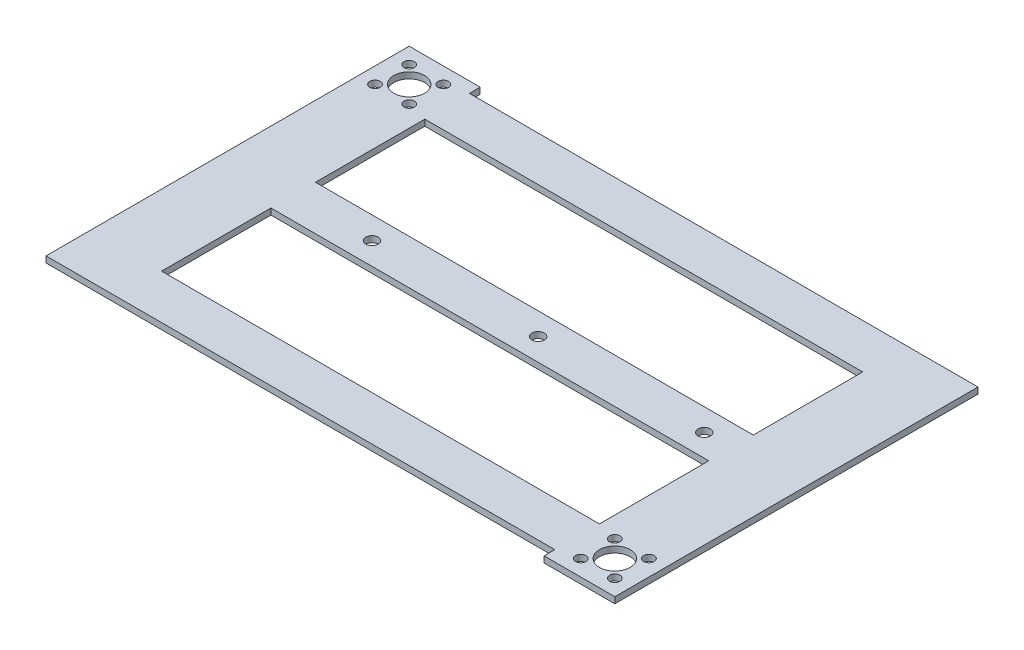
ISO-10303-21;
HEADER;
FILE_DESCRIPTION(('STEP AP214'),'2;1');
FILE_NAME('part.step','',(''),(''),'','','');
FILE_SCHEMA(('AUTOMOTIVE_DESIGN { 1 0 10303 214 1 1 1 1 }'));
ENDSEC;
DATA;
#1=APPLICATION_CONTEXT('core data for automotive mechanical design processes');
#2=APPLICATION_PROTOCOL_DEFINITION('international standard','automotive_design',2000,#1);
#3=PRODUCT_CONTEXT('',#1,'mechanical');
#4=PRODUCT('Part','Part','',(#3));
#5=PRODUCT_RELATED_PRODUCT_CATEGORY('part','',(#4));
#6=PRODUCT_DEFINITION_FORMATION('','',#4);
#7=PRODUCT_DEFINITION_CONTEXT('part definition',#1,'design');
#8=PRODUCT_DEFINITION('design','',#6,#7);
#9=PRODUCT_DEFINITION_SHAPE('','',#8);
#10=(LENGTH_UNIT() NAMED_UNIT(*) SI_UNIT(.MILLI.,.METRE.));
#11=(NAMED_UNIT(*) PLANE_ANGLE_UNIT() SI_UNIT($,.RADIAN.));
#12=(NAMED_UNIT(*) SI_UNIT($,.STERADIAN.) SOLID_ANGLE_UNIT());
#13=UNCERTAINTY_MEASURE_WITH_UNIT(LENGTH_MEASURE(1.E-05),#10,'distance_accuracy_value','');
#14=(GEOMETRIC_REPRESENTATION_CONTEXT(3) GLOBAL_UNCERTAINTY_ASSIGNED_CONTEXT((#13)) GLOBAL_UNIT_ASSIGNED_CONTEXT((#10,
#11,#12)) REPRESENTATION_CONTEXT('',''));
#15=CARTESIAN_POINT('',(0.,0.,0.));
#16=DIRECTION('',(0.,0.,1.));
#17=DIRECTION('',(1.,0.,0.));
#18=AXIS2_PLACEMENT_3D('',#15,#16,#17);
#19=CARTESIAN_POINT('',(0.,2.,0.));
#20=DIRECTION('',(0.,1.,0.));
#21=DIRECTION('',(0.,0.,1.));
#22=AXIS2_PLACEMENT_3D('',#19,#20,#21);
#23=PLANE('',#22);
#24=CARTESIAN_POINT('',(0.,2.,-92.8338294378388));
#25=DIRECTION('',(0.,1.,0.));
#26=DIRECTION('',(0.,0.,1.));
#27=AXIS2_PLACEMENT_3D('',#24,#25,#26);
#28=CIRCLE('',#27,2.);
#29=CARTESIAN_POINT('',(0.,2.,-90.8338294378388));
#30=VERTEX_POINT('',#29);
#31=EDGE_CURVE('E851',#30,#30,#28,.T.);
#32=ORIENTED_EDGE('',*,*,#31,.F.);
#33=EDGE_LOOP('',(#32));
#34=FACE_BOUND('',#33,.T.);
#35=DIRECTION('',(1.,0.,0.));
#36=VECTOR('',#35,1.);
#37=CARTESIAN_POINT('',(-79.6431533882812,2.,-100.08270003643));
#38=LINE('',#37,#36);
#39=CARTESIAN_POINT('',(-79.6431533882812,2.,-100.08270003643));
#40=VERTEX_POINT('',#39);
#41=CARTESIAN_POINT('',(62.7304912118065,2.,-100.08270003643));
#42=VERTEX_POINT('',#41);
#43=EDGE_CURVE('E166',#40,#42,#38,.T.);
#44=ORIENTED_EDGE('',*,*,#43,.F.);
#45=DIRECTION('',(0.,0.,1.));
#46=VECTOR('',#45,1.);
#47=CARTESIAN_POINT('',(-79.6431533882812,2.,-135.633829437839));
#48=LINE('',#47,#46);
#49=CARTESIAN_POINT('',(-79.6431533882812,2.,-135.633829437839));
#50=VERTEX_POINT('',#49);
#51=EDGE_CURVE('E157',#50,#40,#48,.T.);
#52=ORIENTED_EDGE('',*,*,#51,.F.);
#53=DIRECTION('',(-1.,0.,0.));
#54=VECTOR('',#53,1.);
#55=CARTESIAN_POINT('',(-79.6431533882812,2.,-135.633829437839));
#56=LINE('',#55,#54);
#57=CARTESIAN_POINT('',(62.7304912118065,2.,-135.633829437839));
#58=VERTEX_POINT('',#57);
#59=EDGE_CURVE('E184',#58,#50,#56,.T.);
#60=ORIENTED_EDGE('',*,*,#59,.F.);
#61=DIRECTION('',(0.,0.,-1.));
#62=VECTOR('',#61,1.);
#63=CARTESIAN_POINT('',(62.7304912118065,2.,-100.08270003643));
#64=LINE('',#63,#62);
#65=EDGE_CURVE('E180',#42,#58,#64,.T.);
#66=ORIENTED_EDGE('',*,*,#65,.F.);
#67=EDGE_LOOP('',(#44,#52,#60,#66));
#68=FACE_BOUND('',#67,.T.);
#69=CARTESIAN_POINT('',(74.9804912118065,2.,-42.781570635021));
#70=DIRECTION('',(0.,1.,0.));
#71=DIRECTION('',(0.,0.,1.));
#72=AXIS2_PLACEMENT_3D('',#69,#70,#71);
#73=CIRCLE('',#72,4.99999999999999);
#74=CARTESIAN_POINT('',(74.9804912118065,2.,-37.781570635021));
#75=VERTEX_POINT('',#74);
#76=EDGE_CURVE('E208',#75,#75,#73,.T.);
#77=ORIENTED_EDGE('',*,*,#76,.F.);
#78=EDGE_LOOP('',(#77));
#79=FACE_BOUND('',#78,.T.);
#80=CARTESIAN_POINT('',(80.5304912118065,2.,-37.231570635021));
#81=DIRECTION('',(0.,1.,0.));
#82=DIRECTION('',(0.,0.,1.));
#83=AXIS2_PLACEMENT_3D('',#80,#81,#82);
#84=CIRCLE('',#83,1.70000000000001);
#85=CARTESIAN_POINT('',(80.5304912118065,2.,-35.531570635021));
#86=VERTEX_POINT('',#85);
#87=EDGE_CURVE('E267',#86,#86,#84,.T.);
#88=ORIENTED_EDGE('',*,*,#87,.F.);
#89=EDGE_LOOP('',(#88));
#90=FACE_BOUND('',#89,.T.);
#91=CARTESIAN_POINT('',(69.4304912118065,2.,-48.331570635021));
#92=DIRECTION('',(0.,1.,0.));
#93=DIRECTION('',(0.,0.,1.));
#94=AXIS2_PLACEMENT_3D('',#91,#92,#93);
#95=CIRCLE('',#94,1.70000000000001);
#96=CARTESIAN_POINT('',(69.4304912118065,2.,-46.631570635021));
#97=VERTEX_POINT('',#96);
#98=EDGE_CURVE('E283',#97,#97,#95,.T.);
#99=ORIENTED_EDGE('',*,*,#98,.F.);
#100=EDGE_LOOP('',(#99));
#101=FACE_BOUND('',#100,.T.);
#102=CARTESIAN_POINT('',(-91.9770260023349,2.,-142.883829437839));
#103=DIRECTION('',(0.,1.,0.));
#104=DIRECTION('',(0.,0.,1.));
#105=AXIS2_PLACEMENT_3D('',#102,#103,#104);
#106=CIRCLE('',#105,5.00000000000001);
#107=CARTESIAN_POINT('',(-91.9770260023349,2.,-137.883829437839));
#108=VERTEX_POINT('',#107);
#109=EDGE_CURVE('E299',#108,#108,#106,.T.);
#110=ORIENTED_EDGE('',*,*,#109,.F.);
#111=EDGE_LOOP('',(#110));
#112=FACE_BOUND('',#111,.T.);
#113=CARTESIAN_POINT('',(-97.5270260023347,2.,-148.43382943784));
#114=DIRECTION('',(0.,1.,0.));
#115=DIRECTION('',(0.,0.,-1.));
#116=AXIS2_PLACEMENT_3D('',#113,#114,#115);
#117=CIRCLE('',#116,1.70000000000002);
#118=CARTESIAN_POINT('',(-97.5270260023347,2.,-150.13382943784));
#119=VERTEX_POINT('',#118);
#120=EDGE_CURVE('E315',#119,#119,#117,.T.);
#121=ORIENTED_EDGE('',*,*,#120,.F.);
#122=EDGE_LOOP('',(#121));
#123=FACE_BOUND('',#122,.T.);
#124=DIRECTION('',(0.,0.,-1.));
#125=VECTOR('',#124,1.);
#126=CARTESIAN_POINT('',(85.7304912118065,2.,-100.08270003643));
#127=LINE('',#126,#125);
#128=CARTESIAN_POINT('',(85.7304912118065,2.,-32.031570635021));
#129=VERTEX_POINT('',#128);
#130=CARTESIAN_POINT('',(85.7304912118065,2.,-150.13382943784));
#131=VERTEX_POINT('',#130);
#132=EDGE_CURVE('E331',#129,#131,#127,.T.);
#133=ORIENTED_EDGE('',*,*,#132,.T.);
#134=DIRECTION('',(-1.,0.,0.));
#135=VECTOR('',#134,1.);
#136=CARTESIAN_POINT('',(85.7304912118065,2.,-150.13382943784));
#137=LINE('',#136,#135);
#138=CARTESIAN_POINT('',(-79.6431533882812,2.,-150.13382943784));
#139=VERTEX_POINT('',#138);
#140=EDGE_CURVE('E334',#131,#139,#137,.T.);
#141=ORIENTED_EDGE('',*,*,#140,.T.);
#142=DIRECTION('',(0.,0.,-1.));
#143=VECTOR('',#142,1.);
#144=CARTESIAN_POINT('',(-79.6431533882812,2.,-153.432122466439));
#145=LINE('',#144,#143);
#146=CARTESIAN_POINT('',(-79.6431533882812,2.,-153.633829437839));
#147=VERTEX_POINT('',#146);
#148=EDGE_CURVE('E338',#139,#147,#145,.T.);
#149=ORIENTED_EDGE('',*,*,#148,.T.);
#150=DIRECTION('',(-1.,0.,0.));
#151=VECTOR('',#150,1.);
#152=CARTESIAN_POINT('',(-84.6431533882812,2.,-153.633829437839));
#153=LINE('',#152,#151);
#154=CARTESIAN_POINT('',(-102.727026002335,2.,-153.633829437839));
#155=VERTEX_POINT('',#154);
#156=EDGE_CURVE('E341',#147,#155,#153,.T.);
#157=ORIENTED_EDGE('',*,*,#156,.T.);
#158=DIRECTION('',(0.,0.,1.));
#159=VECTOR('',#158,1.);
#160=CARTESIAN_POINT('',(-102.727026002335,2.,-100.08270003643));
#161=LINE('',#160,#159);
#162=CARTESIAN_POINT('',(-102.727026002335,2.,-35.531570635021));
#163=VERTEX_POINT('',#162);
#164=EDGE_CURVE('E344',#155,#163,#161,.T.);
#165=ORIENTED_EDGE('',*,*,#164,.T.);
#166=DIRECTION('',(1.,0.,0.));
#167=VECTOR('',#166,1.);
#168=CARTESIAN_POINT('',(-102.727026002335,2.,-35.531570635021));
#169=LINE('',#168,#167);
#170=CARTESIAN_POINT('',(62.7304912118065,2.,-35.531570635021));
#171=VERTEX_POINT('',#170);
#172=EDGE_CURVE('E347',#163,#171,#169,.T.);
#173=ORIENTED_EDGE('',*,*,#172,.T.);
#174=DIRECTION('',(0.,0.,1.));
#175=VECTOR('',#174,1.);
#176=CARTESIAN_POINT('',(62.7304912118065,2.,-32.031570635021));
#177=LINE('',#176,#175);
#178=CARTESIAN_POINT('',(62.7304912118065,2.,-32.031570635021));
#179=VERTEX_POINT('',#178);
#180=EDGE_CURVE('E350',#171,#179,#177,.T.);
#181=ORIENTED_EDGE('',*,*,#180,.T.);
#182=DIRECTION('',(1.,0.,0.));
#183=VECTOR('',#182,1.);
#184=CARTESIAN_POINT('',(67.7304912118065,2.,-32.031570635021));
#185=LINE('',#184,#183);
#186=EDGE_CURVE('E353',#179,#129,#185,.T.);
#187=ORIENTED_EDGE('',*,*,#186,.T.);
#188=EDGE_LOOP('',(#133,#141,#149,#157,#165,#173,#181,#187));
#189=FACE_BOUND('',#188,.T.);
#190=CARTESIAN_POINT('',(-86.4270260023345,2.,-148.433829437839));
#191=DIRECTION('',(0.,1.,0.));
#192=DIRECTION('',(0.,0.,1.));
#193=AXIS2_PLACEMENT_3D('',#190,#191,#192);
#194=CIRCLE('',#193,1.70000000000001);
#195=CARTESIAN_POINT('',(-86.4270260023345,2.,-146.733829437839));
#196=VERTEX_POINT('',#195);
#197=EDGE_CURVE('E323',#196,#196,#194,.T.);
#198=ORIENTED_EDGE('',*,*,#197,.F.);
#199=EDGE_LOOP('',(#198));
#200=FACE_BOUND('',#199,.T.);
#201=CARTESIAN_POINT('',(-86.4270260023344,2.,-137.333829437839));
#202=DIRECTION('',(0.,1.,0.));
#203=DIRECTION('',(0.,0.,-1.));
#204=AXIS2_PLACEMENT_3D('',#201,#202,#203);
#205=CIRCLE('',#204,1.70000000000001);
#206=CARTESIAN_POINT('',(-86.4270260023344,2.,-139.033829437839));
#207=VERTEX_POINT('',#206);
#208=EDGE_CURVE('E307',#207,#207,#205,.T.);
#209=ORIENTED_EDGE('',*,*,#208,.F.);
#210=EDGE_LOOP('',(#209));
#211=FACE_BOUND('',#210,.T.);
#212=CARTESIAN_POINT('',(-97.5270260023347,2.,-137.333829437839));
#213=DIRECTION('',(0.,1.,0.));
#214=DIRECTION('',(0.,0.,1.));
#215=AXIS2_PLACEMENT_3D('',#212,#213,#214);
#216=CIRCLE('',#215,1.70000000000001);
#217=CARTESIAN_POINT('',(-97.5270260023347,2.,-135.633829437839));
#218=VERTEX_POINT('',#217);
#219=EDGE_CURVE('E291',#218,#218,#216,.T.);
#220=ORIENTED_EDGE('',*,*,#219,.F.);
#221=EDGE_LOOP('',(#220));
#222=FACE_BOUND('',#221,.T.);
#223=CARTESIAN_POINT('',(80.5304912118065,2.,-48.331570635021));
#224=DIRECTION('',(0.,1.,0.));
#225=DIRECTION('',(0.,0.,-1.));
#226=AXIS2_PLACEMENT_3D('',#223,#224,#225);
#227=CIRCLE('',#226,1.70000000000001);
#228=CARTESIAN_POINT('',(80.5304912118065,2.,-50.031570635021));
#229=VERTEX_POINT('',#228);
#230=EDGE_CURVE('E275',#229,#229,#227,.T.);
#231=ORIENTED_EDGE('',*,*,#230,.F.);
#232=EDGE_LOOP('',(#231));
#233=FACE_BOUND('',#232,.T.);
#234=CARTESIAN_POINT('',(69.4304912118065,2.,-37.231570635021));
#235=DIRECTION('',(0.,1.,0.));
#236=DIRECTION('',(0.,0.,-1.));
#237=AXIS2_PLACEMENT_3D('',#234,#235,#236);
#238=CIRCLE('',#237,1.70000000000001);
#239=CARTESIAN_POINT('',(69.4304912118065,2.,-38.931570635021));
#240=VERTEX_POINT('',#239);
#241=EDGE_CURVE('E259',#240,#240,#238,.T.);
#242=ORIENTED_EDGE('',*,*,#241,.F.);
#243=EDGE_LOOP('',(#242));
#244=FACE_BOUND('',#243,.T.);
#245=DIRECTION('',(1.,0.,0.));
#246=VECTOR('',#245,1.);
#247=CARTESIAN_POINT('',(-79.6431533882812,2.,-50.031570635021));
#248=LINE('',#247,#246);
#249=CARTESIAN_POINT('',(-79.6431533882812,2.,-50.031570635021));
#250=VERTEX_POINT('',#249);
#251=CARTESIAN_POINT('',(62.7304912118065,2.,-50.031570635021));
#252=VERTEX_POINT('',#251);
#253=EDGE_CURVE('E219',#250,#252,#248,.T.);
#254=ORIENTED_EDGE('',*,*,#253,.F.);
#255=DIRECTION('',(0.,0.,1.));
#256=VECTOR('',#255,1.);
#257=CARTESIAN_POINT('',(-79.6431533882812,2.,-85.5827000364299));
#258=LINE('',#257,#256);
#259=CARTESIAN_POINT('',(-79.6431533882812,2.,-85.5827000364299));
#260=VERTEX_POINT('',#259);
#261=EDGE_CURVE('E216',#260,#250,#258,.T.);
#262=ORIENTED_EDGE('',*,*,#261,.F.);
#263=DIRECTION('',(-1.,0.,0.));
#264=VECTOR('',#263,1.);
#265=CARTESIAN_POINT('',(-79.6431533882812,2.,-85.5827000364299));
#266=LINE('',#265,#264);
#267=CARTESIAN_POINT('',(62.7304912118065,2.,-85.5827000364299));
#268=VERTEX_POINT('',#267);
#269=EDGE_CURVE('E227',#268,#260,#266,.T.);
#270=ORIENTED_EDGE('',*,*,#269,.F.);
#271=DIRECTION('',(0.,0.,-1.));
#272=VECTOR('',#271,1.);
#273=CARTESIAN_POINT('',(62.7304912118065,2.,-50.031570635021));
#274=LINE('',#273,#272);
#275=EDGE_CURVE('E223',#252,#268,#274,.T.);
#276=ORIENTED_EDGE('',*,*,#275,.F.);
#277=EDGE_LOOP('',(#254,#262,#270,#276));
#278=FACE_BOUND('',#277,.T.);
#279=CARTESIAN_POINT('',(-54.,2.,-92.8338294378388));
#280=DIRECTION('',(0.,1.,0.));
#281=DIRECTION('',(0.,0.,1.));
#282=AXIS2_PLACEMENT_3D('',#279,#280,#281);
#283=CIRCLE('',#282,2.);
#284=CARTESIAN_POINT('',(-54.,2.,-90.8338294378388));
#285=VERTEX_POINT('',#284);
#286=EDGE_CURVE('E192',#285,#285,#283,.T.);
#287=ORIENTED_EDGE('',*,*,#286,.F.);
#288=EDGE_LOOP('',(#287));
#289=FACE_BOUND('',#288,.T.);
#290=CARTESIAN_POINT('',(54.,2.,-92.8338294378388));
#291=DIRECTION('',(0.,1.,0.));
#292=DIRECTION('',(0.,0.,1.));
#293=AXIS2_PLACEMENT_3D('',#290,#291,#292);
#294=CIRCLE('',#293,2.);
#295=CARTESIAN_POINT('',(54.,2.,-90.8338294378388));
#296=VERTEX_POINT('',#295);
#297=EDGE_CURVE('E840',#296,#296,#294,.T.);
#298=ORIENTED_EDGE('',*,*,#297,.F.);
#299=EDGE_LOOP('',(#298));
#300=FACE_BOUND('',#299,.T.);
#301=ADVANCED_FACE('F43',(#34,#68,#79,#90,#101,#112,#123,#189,#200,#211,#222,#233,#244,#278,
#289,#300),#23,.T.);
#302=CARTESIAN_POINT('',(0.,0.,0.));
#303=DIRECTION('',(0.,1.,0.));
#304=DIRECTION('',(0.,0.,1.));
#305=AXIS2_PLACEMENT_3D('',#302,#303,#304);
#306=PLANE('',#305);
#307=CARTESIAN_POINT('',(74.9804912118065,0.,-42.781570635021));
#308=DIRECTION('',(0.,1.,0.));
#309=DIRECTION('',(0.,0.,1.));
#310=AXIS2_PLACEMENT_3D('',#307,#308,#309);
#311=CIRCLE('',#310,4.99999999999999);
#312=CARTESIAN_POINT('',(74.9804912118065,0.,-37.781570635021));
#313=VERTEX_POINT('',#312);
#314=EDGE_CURVE('E175',#313,#313,#311,.T.);
#315=ORIENTED_EDGE('',*,*,#314,.T.);
#316=EDGE_LOOP('',(#315));
#317=FACE_BOUND('',#316,.T.);
#318=DIRECTION('',(0.,0.,1.));
#319=VECTOR('',#318,1.);
#320=CARTESIAN_POINT('',(-79.6431533882812,0.,-85.5827000364299));
#321=LINE('',#320,#319);
#322=CARTESIAN_POINT('',(-79.6431533882812,0.,-85.5827000364299));
#323=VERTEX_POINT('',#322);
#324=CARTESIAN_POINT('',(-79.6431533882812,0.,-50.031570635021));
#325=VERTEX_POINT('',#324);
#326=EDGE_CURVE('E212',#323,#325,#321,.T.);
#327=ORIENTED_EDGE('',*,*,#326,.T.);
#328=DIRECTION('',(1.,0.,0.));
#329=VECTOR('',#328,1.);
#330=CARTESIAN_POINT('',(-79.6431533882812,0.,-50.031570635021));
#331=LINE('',#330,#329);
#332=CARTESIAN_POINT('',(62.7304912118065,0.,-50.031570635021));
#333=VERTEX_POINT('',#332);
#334=EDGE_CURVE('E234',#325,#333,#331,.T.);
#335=ORIENTED_EDGE('',*,*,#334,.T.);
#336=DIRECTION('',(0.,0.,-1.));
#337=VECTOR('',#336,1.);
#338=CARTESIAN_POINT('',(62.7304912118065,0.,-50.031570635021));
#339=LINE('',#338,#337);
#340=CARTESIAN_POINT('',(62.7304912118065,0.,-85.5827000364299));
#341=VERTEX_POINT('',#340);
#342=EDGE_CURVE('E238',#333,#341,#339,.T.);
#343=ORIENTED_EDGE('',*,*,#342,.T.);
#344=DIRECTION('',(-1.,0.,0.));
#345=VECTOR('',#344,1.);
#346=CARTESIAN_POINT('',(-79.6431533882812,0.,-85.5827000364299));
#347=LINE('',#346,#345);
#348=EDGE_CURVE('E220',#341,#323,#347,.T.);
#349=ORIENTED_EDGE('',*,*,#348,.T.);
#350=EDGE_LOOP('',(#327,#335,#343,#349));
#351=FACE_BOUND('',#350,.T.);
#352=DIRECTION('',(-1.,0.,0.));
#353=VECTOR('',#352,1.);
#354=CARTESIAN_POINT('',(-79.6431533882812,0.,-150.13382943784));
#355=LINE('',#354,#353);
#356=CARTESIAN_POINT('',(85.7304912118065,0.,-150.13382943784));
#357=VERTEX_POINT('',#356);
#358=CARTESIAN_POINT('',(-79.6431533882812,0.,-150.13382943784));
#359=VERTEX_POINT('',#358);
#360=EDGE_CURVE('E327',#357,#359,#355,.T.);
#361=ORIENTED_EDGE('',*,*,#360,.F.);
#362=DIRECTION('',(0.,0.,-1.));
#363=VECTOR('',#362,1.);
#364=CARTESIAN_POINT('',(85.7304912118065,0.,-50.031570635021));
#365=LINE('',#364,#363);
#366=CARTESIAN_POINT('',(85.7304912118065,0.,-32.031570635021));
#367=VERTEX_POINT('',#366);
#368=EDGE_CURVE('E335',#367,#357,#365,.T.);
#369=ORIENTED_EDGE('',*,*,#368,.F.);
#370=DIRECTION('',(1.,0.,0.));
#371=VECTOR('',#370,1.);
#372=CARTESIAN_POINT('',(67.7304912118065,0.,-32.031570635021));
#373=LINE('',#372,#371);
#374=CARTESIAN_POINT('',(62.7304912118065,0.,-32.031570635021));
#375=VERTEX_POINT('',#374);
#376=EDGE_CURVE('E379',#375,#367,#373,.T.);
#377=ORIENTED_EDGE('',*,*,#376,.F.);
#378=DIRECTION('',(0.,0.,1.));
#379=VECTOR('',#378,1.);
#380=CARTESIAN_POINT('',(62.7304912118065,0.,-32.031570635021));
#381=LINE('',#380,#379);
#382=CARTESIAN_POINT('',(62.7304912118065,0.,-35.531570635021));
#383=VERTEX_POINT('',#382);
#384=EDGE_CURVE('E375',#383,#375,#381,.T.);
#385=ORIENTED_EDGE('',*,*,#384,.F.);
#386=DIRECTION('',(1.,0.,0.));
#387=VECTOR('',#386,1.);
#388=CARTESIAN_POINT('',(-84.7270260023345,0.,-35.531570635021));
#389=LINE('',#388,#387);
#390=CARTESIAN_POINT('',(-102.727026002335,0.,-35.531570635021));
#391=VERTEX_POINT('',#390);
#392=EDGE_CURVE('E372',#391,#383,#389,.T.);
#393=ORIENTED_EDGE('',*,*,#392,.F.);
#394=DIRECTION('',(0.,0.,1.));
#395=VECTOR('',#394,1.);
#396=CARTESIAN_POINT('',(-102.727026002335,0.,-85.5827000364299));
#397=LINE('',#396,#395);
#398=CARTESIAN_POINT('',(-102.727026002335,0.,-153.633829437839));
#399=VERTEX_POINT('',#398);
#400=EDGE_CURVE('E368',#399,#391,#397,.T.);
#401=ORIENTED_EDGE('',*,*,#400,.F.);
#402=DIRECTION('',(-1.,0.,0.));
#403=VECTOR('',#402,1.);
#404=CARTESIAN_POINT('',(-84.6431533882812,0.,-153.633829437839));
#405=LINE('',#404,#403);
#406=CARTESIAN_POINT('',(-79.6431533882812,0.,-153.633829437839));
#407=VERTEX_POINT('',#406);
#408=EDGE_CURVE('E364',#407,#399,#405,.T.);
#409=ORIENTED_EDGE('',*,*,#408,.F.);
#410=DIRECTION('',(0.,0.,-1.));
#411=VECTOR('',#410,1.);
#412=CARTESIAN_POINT('',(-79.6431533882812,0.,-153.432122466439));
#413=LINE('',#412,#411);
#414=EDGE_CURVE('E360',#359,#407,#413,.T.);
#415=ORIENTED_EDGE('',*,*,#414,.F.);
#416=EDGE_LOOP('',(#361,#369,#377,#385,#393,#401,#409,#415));
#417=FACE_BOUND('',#416,.T.);
#418=CARTESIAN_POINT('',(-86.4270260023345,0.,-148.433829437839));
#419=DIRECTION('',(0.,1.,0.));
#420=DIRECTION('',(0.,0.,1.));
#421=AXIS2_PLACEMENT_3D('',#418,#419,#420);
#422=CIRCLE('',#421,1.70000000000001);
#423=CARTESIAN_POINT('',(-86.4270260023345,0.,-146.733829437839));
#424=VERTEX_POINT('',#423);
#425=EDGE_CURVE('E319',#424,#424,#422,.T.);
#426=ORIENTED_EDGE('',*,*,#425,.T.);
#427=EDGE_LOOP('',(#426));
#428=FACE_BOUND('',#427,.T.);
#429=CARTESIAN_POINT('',(-97.5270260023347,0.,-148.43382943784));
#430=DIRECTION('',(0.,1.,0.));
#431=DIRECTION('',(0.,0.,-1.));
#432=AXIS2_PLACEMENT_3D('',#429,#430,#431);
#433=CIRCLE('',#432,1.70000000000002);
#434=CARTESIAN_POINT('',(-97.5270260023347,0.,-150.13382943784));
#435=VERTEX_POINT('',#434);
#436=EDGE_CURVE('E311',#435,#435,#433,.T.);
#437=ORIENTED_EDGE('',*,*,#436,.T.);
#438=EDGE_LOOP('',(#437));
#439=FACE_BOUND('',#438,.T.);
#440=CARTESIAN_POINT('',(-86.4270260023344,0.,-137.333829437839));
#441=DIRECTION('',(0.,1.,0.));
#442=DIRECTION('',(0.,0.,-1.));
#443=AXIS2_PLACEMENT_3D('',#440,#441,#442);
#444=CIRCLE('',#443,1.70000000000001);
#445=CARTESIAN_POINT('',(-86.4270260023344,0.,-139.033829437839));
#446=VERTEX_POINT('',#445);
#447=EDGE_CURVE('E303',#446,#446,#444,.T.);
#448=ORIENTED_EDGE('',*,*,#447,.T.);
#449=EDGE_LOOP('',(#448));
#450=FACE_BOUND('',#449,.T.);
#451=CARTESIAN_POINT('',(-91.9770260023349,0.,-142.883829437839));
#452=DIRECTION('',(0.,1.,0.));
#453=DIRECTION('',(0.,0.,1.));
#454=AXIS2_PLACEMENT_3D('',#451,#452,#453);
#455=CIRCLE('',#454,5.00000000000001);
#456=CARTESIAN_POINT('',(-91.9770260023349,0.,-137.883829437839));
#457=VERTEX_POINT('',#456);
#458=EDGE_CURVE('E295',#457,#457,#455,.T.);
#459=ORIENTED_EDGE('',*,*,#458,.T.);
#460=EDGE_LOOP('',(#459));
#461=FACE_BOUND('',#460,.T.);
#462=CARTESIAN_POINT('',(-97.5270260023347,0.,-137.333829437839));
#463=DIRECTION('',(0.,1.,0.));
#464=DIRECTION('',(0.,0.,1.));
#465=AXIS2_PLACEMENT_3D('',#462,#463,#464);
#466=CIRCLE('',#465,1.70000000000001);
#467=CARTESIAN_POINT('',(-97.5270260023347,0.,-135.633829437839));
#468=VERTEX_POINT('',#467);
#469=EDGE_CURVE('E287',#468,#468,#466,.T.);
#470=ORIENTED_EDGE('',*,*,#469,.T.);
#471=EDGE_LOOP('',(#470));
#472=FACE_BOUND('',#471,.T.);
#473=CARTESIAN_POINT('',(69.4304912118065,0.,-48.331570635021));
#474=DIRECTION('',(0.,1.,0.));
#475=DIRECTION('',(0.,0.,1.));
#476=AXIS2_PLACEMENT_3D('',#473,#474,#475);
#477=CIRCLE('',#476,1.70000000000001);
#478=CARTESIAN_POINT('',(69.4304912118065,0.,-46.631570635021));
#479=VERTEX_POINT('',#478);
#480=EDGE_CURVE('E279',#479,#479,#477,.T.);
#481=ORIENTED_EDGE('',*,*,#480,.T.);
#482=EDGE_LOOP('',(#481));
#483=FACE_BOUND('',#482,.T.);
#484=CARTESIAN_POINT('',(80.5304912118065,0.,-48.331570635021));
#485=DIRECTION('',(0.,1.,0.));
#486=DIRECTION('',(0.,0.,-1.));
#487=AXIS2_PLACEMENT_3D('',#484,#485,#486);
#488=CIRCLE('',#487,1.70000000000001);
#489=CARTESIAN_POINT('',(80.5304912118065,0.,-50.031570635021));
#490=VERTEX_POINT('',#489);
#491=EDGE_CURVE('E271',#490,#490,#488,.T.);
#492=ORIENTED_EDGE('',*,*,#491,.T.);
#493=EDGE_LOOP('',(#492));
#494=FACE_BOUND('',#493,.T.);
#495=CARTESIAN_POINT('',(80.5304912118065,0.,-37.231570635021));
#496=DIRECTION('',(0.,1.,0.));
#497=DIRECTION('',(0.,0.,1.));
#498=AXIS2_PLACEMENT_3D('',#495,#496,#497);
#499=CIRCLE('',#498,1.70000000000001);
#500=CARTESIAN_POINT('',(80.5304912118065,0.,-35.531570635021));
#501=VERTEX_POINT('',#500);
#502=EDGE_CURVE('E263',#501,#501,#499,.T.);
#503=ORIENTED_EDGE('',*,*,#502,.T.);
#504=EDGE_LOOP('',(#503));
#505=FACE_BOUND('',#504,.T.);
#506=CARTESIAN_POINT('',(69.4304912118065,0.,-37.231570635021));
#507=DIRECTION('',(0.,1.,0.));
#508=DIRECTION('',(0.,0.,-1.));
#509=AXIS2_PLACEMENT_3D('',#506,#507,#508);
#510=CIRCLE('',#509,1.70000000000001);
#511=CARTESIAN_POINT('',(69.4304912118065,0.,-38.931570635021));
#512=VERTEX_POINT('',#511);
#513=EDGE_CURVE('E258',#512,#512,#510,.T.);
#514=ORIENTED_EDGE('',*,*,#513,.T.);
#515=EDGE_LOOP('',(#514));
#516=FACE_BOUND('',#515,.T.);
#517=DIRECTION('',(0.,0.,1.));
#518=VECTOR('',#517,1.);
#519=CARTESIAN_POINT('',(-79.6431533882812,0.,-135.633829437839));
#520=LINE('',#519,#518);
#521=CARTESIAN_POINT('',(-79.6431533882812,0.,-135.633829437839));
#522=VERTEX_POINT('',#521);
#523=CARTESIAN_POINT('',(-79.6431533882812,0.,-100.08270003643));
#524=VERTEX_POINT('',#523);
#525=EDGE_CURVE('E67',#522,#524,#520,.T.);
#526=ORIENTED_EDGE('',*,*,#525,.T.);
#527=DIRECTION('',(1.,0.,0.));
#528=VECTOR('',#527,1.);
#529=CARTESIAN_POINT('',(-79.6431533882812,0.,-100.08270003643));
#530=LINE('',#529,#528);
#531=CARTESIAN_POINT('',(62.7304912118065,0.,-100.08270003643));
#532=VERTEX_POINT('',#531);
#533=EDGE_CURVE('E173',#524,#532,#530,.T.);
#534=ORIENTED_EDGE('',*,*,#533,.T.);
#535=DIRECTION('',(0.,0.,-1.));
#536=VECTOR('',#535,1.);
#537=CARTESIAN_POINT('',(62.7304912118065,0.,-100.08270003643));
#538=LINE('',#537,#536);
#539=CARTESIAN_POINT('',(62.7304912118065,0.,-135.633829437839));
#540=VERTEX_POINT('',#539);
#541=EDGE_CURVE('E195',#532,#540,#538,.T.);
#542=ORIENTED_EDGE('',*,*,#541,.T.);
#543=DIRECTION('',(-1.,0.,0.));
#544=VECTOR('',#543,1.);
#545=CARTESIAN_POINT('',(-79.6431533882812,0.,-135.633829437839));
#546=LINE('',#545,#544);
#547=EDGE_CURVE('E167',#540,#522,#546,.T.);
#548=ORIENTED_EDGE('',*,*,#547,.T.);
#549=EDGE_LOOP('',(#526,#534,#542,#548));
#550=FACE_BOUND('',#549,.T.);
#551=CARTESIAN_POINT('',(-54.,0.,-92.8338294378388));
#552=DIRECTION('',(0.,1.,0.));
#553=DIRECTION('',(0.,0.,1.));
#554=AXIS2_PLACEMENT_3D('',#551,#552,#553);
#555=CIRCLE('',#554,2.);
#556=CARTESIAN_POINT('',(-54.,0.,-90.8338294378388));
#557=VERTEX_POINT('',#556);
#558=EDGE_CURVE('E855',#557,#557,#555,.T.);
#559=ORIENTED_EDGE('',*,*,#558,.T.);
#560=EDGE_LOOP('',(#559));
#561=FACE_BOUND('',#560,.T.);
#562=CARTESIAN_POINT('',(0.,0.,-92.8338294378388));
#563=DIRECTION('',(0.,1.,0.));
#564=DIRECTION('',(0.,0.,1.));
#565=AXIS2_PLACEMENT_3D('',#562,#563,#564);
#566=CIRCLE('',#565,2.);
#567=CARTESIAN_POINT('',(0.,0.,-90.8338294378388));
#568=VERTEX_POINT('',#567);
#569=EDGE_CURVE('E848',#568,#568,#566,.T.);
#570=ORIENTED_EDGE('',*,*,#569,.T.);
#571=EDGE_LOOP('',(#570));
#572=FACE_BOUND('',#571,.T.);
#573=CARTESIAN_POINT('',(54.,0.,-92.8338294378388));
#574=DIRECTION('',(0.,1.,0.));
#575=DIRECTION('',(0.,0.,1.));
#576=AXIS2_PLACEMENT_3D('',#573,#574,#575);
#577=CIRCLE('',#576,2.);
#578=CARTESIAN_POINT('',(54.,0.,-90.8338294378388));
#579=VERTEX_POINT('',#578);
#580=EDGE_CURVE('E843',#579,#579,#577,.T.);
#581=ORIENTED_EDGE('',*,*,#580,.T.);
#582=EDGE_LOOP('',(#581));
#583=FACE_BOUND('',#582,.T.);
#584=ADVANCED_FACE('F419',(#317,#351,#417,#428,#439,#450,#461,#472,#483,#494,#505,#516,#550,
#561,#572,#583),#306,.F.);
#585=CARTESIAN_POINT('',(-79.6431533882812,2.,-150.13382943784));
#586=DIRECTION('',(0.,0.,1.));
#587=DIRECTION('',(1.,0.,0.));
#588=AXIS2_PLACEMENT_3D('',#585,#586,#587);
#589=PLANE('',#588);
#590=ORIENTED_EDGE('',*,*,#360,.T.);
#591=DIRECTION('',(0.,-1.,0.));
#592=VECTOR('',#591,1.);
#593=CARTESIAN_POINT('',(-79.6431533882812,2.,-150.13382943784));
#594=LINE('',#593,#592);
#595=EDGE_CURVE('E52',#139,#359,#594,.T.);
#596=ORIENTED_EDGE('',*,*,#595,.F.);
#597=ORIENTED_EDGE('',*,*,#140,.F.);
#598=DIRECTION('',(0.,-1.,0.));
#599=VECTOR('',#598,1.);
#600=CARTESIAN_POINT('',(85.7304912118065,2.,-150.13382943784));
#601=LINE('',#600,#599);
#602=EDGE_CURVE('E11',#131,#357,#601,.T.);
#603=ORIENTED_EDGE('',*,*,#602,.T.);
#604=EDGE_LOOP('',(#590,#596,#597,#603));
#605=FACE_BOUND('',#604,.T.);
#606=ADVANCED_FACE('F45',(#605),#589,.F.);
#607=CARTESIAN_POINT('',(-79.6431533882812,2.,-153.432122466439));
#608=DIRECTION('',(-1.,0.,0.));
#609=DIRECTION('',(0.,0.,1.));
#610=AXIS2_PLACEMENT_3D('',#607,#608,#609);
#611=PLANE('',#610);
#612=ORIENTED_EDGE('',*,*,#414,.T.);
#613=DIRECTION('',(0.,-1.,0.));
#614=VECTOR('',#613,1.);
#615=CARTESIAN_POINT('',(-79.6431533882812,2.,-153.633829437839));
#616=LINE('',#615,#614);
#617=EDGE_CURVE('E404',#147,#407,#616,.T.);
#618=ORIENTED_EDGE('',*,*,#617,.F.);
#619=ORIENTED_EDGE('',*,*,#148,.F.);
#620=ORIENTED_EDGE('',*,*,#595,.T.);
#621=EDGE_LOOP('',(#612,#618,#619,#620));
#622=FACE_BOUND('',#621,.T.);
#623=ADVANCED_FACE('F412',(#622),#611,.F.);
#624=CARTESIAN_POINT('',(-84.6431533882812,2.,-153.633829437839));
#625=DIRECTION('',(0.,0.,1.));
#626=DIRECTION('',(1.,0.,0.));
#627=AXIS2_PLACEMENT_3D('',#624,#625,#626);
#628=PLANE('',#627);
#629=ORIENTED_EDGE('',*,*,#408,.T.);
#630=DIRECTION('',(0.,-1.,0.));
#631=VECTOR('',#630,1.);
#632=CARTESIAN_POINT('',(-102.727026002335,2.,-153.633829437839));
#633=LINE('',#632,#631);
#634=EDGE_CURVE('E400',#155,#399,#633,.T.);
#635=ORIENTED_EDGE('',*,*,#634,.F.);
#636=ORIENTED_EDGE('',*,*,#156,.F.);
#637=ORIENTED_EDGE('',*,*,#617,.T.);
#638=EDGE_LOOP('',(#629,#635,#636,#637));
#639=FACE_BOUND('',#638,.T.);
#640=ADVANCED_FACE('F423',(#639),#628,.F.);
#641=CARTESIAN_POINT('',(-102.727026002335,2.,-85.5827000364299));
#642=DIRECTION('',(1.,0.,0.));
#643=DIRECTION('',(0.,0.,-1.));
#644=AXIS2_PLACEMENT_3D('',#641,#642,#643);
#645=PLANE('',#644);
#646=ORIENTED_EDGE('',*,*,#400,.T.);
#647=DIRECTION('',(0.,-1.,0.));
#648=VECTOR('',#647,1.);
#649=CARTESIAN_POINT('',(-102.727026002335,2.,-35.531570635021));
#650=LINE('',#649,#648);
#651=EDGE_CURVE('E396',#163,#391,#650,.T.);
#652=ORIENTED_EDGE('',*,*,#651,.F.);
#653=ORIENTED_EDGE('',*,*,#164,.F.);
#654=ORIENTED_EDGE('',*,*,#634,.T.);
#655=EDGE_LOOP('',(#646,#652,#653,#654));
#656=FACE_BOUND('',#655,.T.);
#657=ADVANCED_FACE('F427',(#656),#645,.F.);
#658=CARTESIAN_POINT('',(-84.7270260023345,2.,-35.531570635021));
#659=DIRECTION('',(0.,0.,-1.));
#660=DIRECTION('',(-1.,0.,0.));
#661=AXIS2_PLACEMENT_3D('',#658,#659,#660);
#662=PLANE('',#661);
#663=ORIENTED_EDGE('',*,*,#392,.T.);
#664=DIRECTION('',(0.,-1.,0.));
#665=VECTOR('',#664,1.);
#666=CARTESIAN_POINT('',(62.7304912118065,2.,-35.531570635021));
#667=LINE('',#666,#665);
#668=EDGE_CURVE('E392',#171,#383,#667,.T.);
#669=ORIENTED_EDGE('',*,*,#668,.F.);
#670=ORIENTED_EDGE('',*,*,#172,.F.);
#671=ORIENTED_EDGE('',*,*,#651,.T.);
#672=EDGE_LOOP('',(#663,#669,#670,#671));
#673=FACE_BOUND('',#672,.T.);
#674=ADVANCED_FACE('F446',(#673),#662,.F.);
#675=CARTESIAN_POINT('',(62.7304912118065,2.,-32.031570635021));
#676=DIRECTION('',(1.,0.,0.));
#677=DIRECTION('',(0.,0.,-1.));
#678=AXIS2_PLACEMENT_3D('',#675,#676,#677);
#679=PLANE('',#678);
#680=ORIENTED_EDGE('',*,*,#384,.T.);
#681=DIRECTION('',(0.,-1.,0.));
#682=VECTOR('',#681,1.);
#683=CARTESIAN_POINT('',(62.7304912118065,2.,-32.031570635021));
#684=LINE('',#683,#682);
#685=EDGE_CURVE('E388',#179,#375,#684,.T.);
#686=ORIENTED_EDGE('',*,*,#685,.F.);
#687=ORIENTED_EDGE('',*,*,#180,.F.);
#688=ORIENTED_EDGE('',*,*,#668,.T.);
#689=EDGE_LOOP('',(#680,#686,#687,#688));
#690=FACE_BOUND('',#689,.T.);
#691=ADVANCED_FACE('F443',(#690),#679,.F.);
#692=CARTESIAN_POINT('',(67.7304912118065,2.,-32.031570635021));
#693=DIRECTION('',(0.,0.,-1.));
#694=DIRECTION('',(-1.,0.,0.));
#695=AXIS2_PLACEMENT_3D('',#692,#693,#694);
#696=PLANE('',#695);
#697=ORIENTED_EDGE('',*,*,#376,.T.);
#698=DIRECTION('',(0.,-1.,0.));
#699=VECTOR('',#698,1.);
#700=CARTESIAN_POINT('',(85.7304912118065,2.,-32.031570635021));
#701=LINE('',#700,#699);
#702=EDGE_CURVE('E356',#129,#367,#701,.T.);
#703=ORIENTED_EDGE('',*,*,#702,.F.);
#704=ORIENTED_EDGE('',*,*,#186,.F.);
#705=ORIENTED_EDGE('',*,*,#685,.T.);
#706=EDGE_LOOP('',(#697,#703,#704,#705));
#707=FACE_BOUND('',#706,.T.);
#708=ADVANCED_FACE('F439',(#707),#696,.F.);
#709=CARTESIAN_POINT('',(85.7304912118065,2.,-50.031570635021));
#710=DIRECTION('',(-1.,0.,0.));
#711=DIRECTION('',(0.,0.,1.));
#712=AXIS2_PLACEMENT_3D('',#709,#710,#711);
#713=PLANE('',#712);
#714=ORIENTED_EDGE('',*,*,#368,.T.);
#715=ORIENTED_EDGE('',*,*,#602,.F.);
#716=ORIENTED_EDGE('',*,*,#132,.F.);
#717=ORIENTED_EDGE('',*,*,#702,.T.);
#718=EDGE_LOOP('',(#714,#715,#716,#717));
#719=FACE_BOUND('',#718,.T.);
#720=ADVANCED_FACE('F437',(#719),#713,.F.);
#721=CARTESIAN_POINT('',(-86.4270260023345,2.,-148.433829437839));
#722=DIRECTION('',(0.,-1.,0.));
#723=DIRECTION('',(0.,0.,-1.));
#724=AXIS2_PLACEMENT_3D('',#721,#722,#723);
#725=CYLINDRICAL_SURFACE('',#724,1.70000000000001);
#726=ORIENTED_EDGE('',*,*,#197,.T.);
#727=EDGE_LOOP('',(#726));
#728=FACE_BOUND('',#727,.T.);
#729=ORIENTED_EDGE('',*,*,#425,.F.);
#730=EDGE_LOOP('',(#729));
#731=FACE_BOUND('',#730,.T.);
#732=ADVANCED_FACE('F465',(#728,#731),#725,.F.);
#733=CARTESIAN_POINT('',(-97.5270260023347,2.,-148.43382943784));
#734=DIRECTION('',(0.,-1.,0.));
#735=DIRECTION('',(0.,0.,-1.));
#736=AXIS2_PLACEMENT_3D('',#733,#734,#735);
#737=CYLINDRICAL_SURFACE('',#736,1.70000000000002);
#738=ORIENTED_EDGE('',*,*,#120,.T.);
#739=EDGE_LOOP('',(#738));
#740=FACE_BOUND('',#739,.T.);
#741=ORIENTED_EDGE('',*,*,#436,.F.);
#742=EDGE_LOOP('',(#741));
#743=FACE_BOUND('',#742,.T.);
#744=ADVANCED_FACE('F485',(#740,#743),#737,.F.);
#745=CARTESIAN_POINT('',(-86.4270260023344,2.,-137.333829437839));
#746=DIRECTION('',(0.,-1.,0.));
#747=DIRECTION('',(0.,0.,-1.));
#748=AXIS2_PLACEMENT_3D('',#745,#746,#747);
#749=CYLINDRICAL_SURFACE('',#748,1.70000000000001);
#750=ORIENTED_EDGE('',*,*,#208,.T.);
#751=EDGE_LOOP('',(#750));
#752=FACE_BOUND('',#751,.T.);
#753=ORIENTED_EDGE('',*,*,#447,.F.);
#754=EDGE_LOOP('',(#753));
#755=FACE_BOUND('',#754,.T.);
#756=ADVANCED_FACE('F492',(#752,#755),#749,.F.);
#757=CARTESIAN_POINT('',(-91.9770260023349,2.,-142.883829437839));
#758=DIRECTION('',(0.,-1.,0.));
#759=DIRECTION('',(0.,0.,-1.));
#760=AXIS2_PLACEMENT_3D('',#757,#758,#759);
#761=CYLINDRICAL_SURFACE('',#760,5.00000000000001);
#762=ORIENTED_EDGE('',*,*,#109,.T.);
#763=EDGE_LOOP('',(#762));
#764=FACE_BOUND('',#763,.T.);
#765=ORIENTED_EDGE('',*,*,#458,.F.);
#766=EDGE_LOOP('',(#765));
#767=FACE_BOUND('',#766,.T.);
#768=ADVANCED_FACE('F499',(#764,#767),#761,.F.);
#769=CARTESIAN_POINT('',(-97.5270260023347,2.,-137.333829437839));
#770=DIRECTION('',(0.,-1.,0.));
#771=DIRECTION('',(0.,0.,-1.));
#772=AXIS2_PLACEMENT_3D('',#769,#770,#771);
#773=CYLINDRICAL_SURFACE('',#772,1.70000000000001);
#774=ORIENTED_EDGE('',*,*,#219,.T.);
#775=EDGE_LOOP('',(#774));
#776=FACE_BOUND('',#775,.T.);
#777=ORIENTED_EDGE('',*,*,#469,.F.);
#778=EDGE_LOOP('',(#777));
#779=FACE_BOUND('',#778,.T.);
#780=ADVANCED_FACE('F507',(#776,#779),#773,.F.);
#781=CARTESIAN_POINT('',(69.4304912118065,2.,-48.331570635021));
#782=DIRECTION('',(0.,-1.,0.));
#783=DIRECTION('',(0.,0.,-1.));
#784=AXIS2_PLACEMENT_3D('',#781,#782,#783);
#785=CYLINDRICAL_SURFACE('',#784,1.70000000000001);
#786=ORIENTED_EDGE('',*,*,#98,.T.);
#787=EDGE_LOOP('',(#786));
#788=FACE_BOUND('',#787,.T.);
#789=ORIENTED_EDGE('',*,*,#480,.F.);
#790=EDGE_LOOP('',(#789));
#791=FACE_BOUND('',#790,.T.);
#792=ADVANCED_FACE('F515',(#788,#791),#785,.F.);
#793=CARTESIAN_POINT('',(80.5304912118065,2.,-48.331570635021));
#794=DIRECTION('',(0.,-1.,0.));
#795=DIRECTION('',(0.,0.,-1.));
#796=AXIS2_PLACEMENT_3D('',#793,#794,#795);
#797=CYLINDRICAL_SURFACE('',#796,1.70000000000001);
#798=ORIENTED_EDGE('',*,*,#230,.T.);
#799=EDGE_LOOP('',(#798));
#800=FACE_BOUND('',#799,.T.);
#801=ORIENTED_EDGE('',*,*,#491,.F.);
#802=EDGE_LOOP('',(#801));
#803=FACE_BOUND('',#802,.T.);
#804=ADVANCED_FACE('F523',(#800,#803),#797,.F.);
#805=CARTESIAN_POINT('',(80.5304912118065,2.,-37.231570635021));
#806=DIRECTION('',(0.,-1.,0.));
#807=DIRECTION('',(0.,0.,-1.));
#808=AXIS2_PLACEMENT_3D('',#805,#806,#807);
#809=CYLINDRICAL_SURFACE('',#808,1.70000000000001);
#810=ORIENTED_EDGE('',*,*,#87,.T.);
#811=EDGE_LOOP('',(#810));
#812=FACE_BOUND('',#811,.T.);
#813=ORIENTED_EDGE('',*,*,#502,.F.);
#814=EDGE_LOOP('',(#813));
#815=FACE_BOUND('',#814,.T.);
#816=ADVANCED_FACE('F531',(#812,#815),#809,.F.);
#817=CARTESIAN_POINT('',(69.4304912118065,2.,-37.231570635021));
#818=DIRECTION('',(0.,-1.,0.));
#819=DIRECTION('',(0.,0.,-1.));
#820=AXIS2_PLACEMENT_3D('',#817,#818,#819);
#821=CYLINDRICAL_SURFACE('',#820,1.70000000000001);
#822=ORIENTED_EDGE('',*,*,#241,.T.);
#823=EDGE_LOOP('',(#822));
#824=FACE_BOUND('',#823,.T.);
#825=ORIENTED_EDGE('',*,*,#513,.F.);
#826=EDGE_LOOP('',(#825));
#827=FACE_BOUND('',#826,.T.);
#828=ADVANCED_FACE('F539',(#824,#827),#821,.F.);
#829=CARTESIAN_POINT('',(-79.6431533882812,2.,-85.5827000364299));
#830=DIRECTION('',(1.,0.,0.));
#831=DIRECTION('',(0.,0.,-1.));
#832=AXIS2_PLACEMENT_3D('',#829,#830,#831);
#833=PLANE('',#832);
#834=ORIENTED_EDGE('',*,*,#326,.F.);
#835=DIRECTION('',(0.,-1.,0.));
#836=VECTOR('',#835,1.);
#837=CARTESIAN_POINT('',(-79.6431533882812,2.,-85.5827000364299));
#838=LINE('',#837,#836);
#839=EDGE_CURVE('E230',#260,#323,#838,.T.);
#840=ORIENTED_EDGE('',*,*,#839,.F.);
#841=ORIENTED_EDGE('',*,*,#261,.T.);
#842=DIRECTION('',(0.,-1.,0.));
#843=VECTOR('',#842,1.);
#844=CARTESIAN_POINT('',(-79.6431533882812,2.,-50.031570635021));
#845=LINE('',#844,#843);
#846=EDGE_CURVE('E254',#250,#325,#845,.T.);
#847=ORIENTED_EDGE('',*,*,#846,.T.);
#848=EDGE_LOOP('',(#834,#840,#841,#847));
#849=FACE_BOUND('',#848,.T.);
#850=ADVANCED_FACE('F547',(#849),#833,.T.);
#851=CARTESIAN_POINT('',(-79.6431533882812,2.,-50.031570635021));
#852=DIRECTION('',(0.,0.,-1.));
#853=DIRECTION('',(-1.,0.,0.));
#854=AXIS2_PLACEMENT_3D('',#851,#852,#853);
#855=PLANE('',#854);
#856=ORIENTED_EDGE('',*,*,#334,.F.);
#857=ORIENTED_EDGE('',*,*,#846,.F.);
#858=ORIENTED_EDGE('',*,*,#253,.T.);
#859=DIRECTION('',(0.,-1.,0.));
#860=VECTOR('',#859,1.);
#861=CARTESIAN_POINT('',(62.7304912118065,2.,-50.031570635021));
#862=LINE('',#861,#860);
#863=EDGE_CURVE('E251',#252,#333,#862,.T.);
#864=ORIENTED_EDGE('',*,*,#863,.T.);
#865=EDGE_LOOP('',(#856,#857,#858,#864));
#866=FACE_BOUND('',#865,.T.);
#867=ADVANCED_FACE('F555',(#866),#855,.T.);
#868=CARTESIAN_POINT('',(62.7304912118065,2.,-50.031570635021));
#869=DIRECTION('',(-1.,0.,0.));
#870=DIRECTION('',(0.,0.,1.));
#871=AXIS2_PLACEMENT_3D('',#868,#869,#870);
#872=PLANE('',#871);
#873=ORIENTED_EDGE('',*,*,#342,.F.);
#874=ORIENTED_EDGE('',*,*,#863,.F.);
#875=ORIENTED_EDGE('',*,*,#275,.T.);
#876=DIRECTION('',(0.,-1.,0.));
#877=VECTOR('',#876,1.);
#878=CARTESIAN_POINT('',(62.7304912118065,2.,-85.5827000364299));
#879=LINE('',#878,#877);
#880=EDGE_CURVE('E248',#268,#341,#879,.T.);
#881=ORIENTED_EDGE('',*,*,#880,.T.);
#882=EDGE_LOOP('',(#873,#874,#875,#881));
#883=FACE_BOUND('',#882,.T.);
#884=ADVANCED_FACE('F563',(#883),#872,.T.);
#885=CARTESIAN_POINT('',(-79.6431533882812,2.,-85.5827000364299));
#886=DIRECTION('',(0.,0.,1.));
#887=DIRECTION('',(1.,0.,0.));
#888=AXIS2_PLACEMENT_3D('',#885,#886,#887);
#889=PLANE('',#888);
#890=ORIENTED_EDGE('',*,*,#348,.F.);
#891=ORIENTED_EDGE('',*,*,#880,.F.);
#892=ORIENTED_EDGE('',*,*,#269,.T.);
#893=ORIENTED_EDGE('',*,*,#839,.T.);
#894=EDGE_LOOP('',(#890,#891,#892,#893));
#895=FACE_BOUND('',#894,.T.);
#896=ADVANCED_FACE('F571',(#895),#889,.T.);
#897=CARTESIAN_POINT('',(74.9804912118065,2.,-42.781570635021));
#898=DIRECTION('',(0.,-1.,0.));
#899=DIRECTION('',(0.,0.,-1.));
#900=AXIS2_PLACEMENT_3D('',#897,#898,#899);
#901=CYLINDRICAL_SURFACE('',#900,4.99999999999999);
#902=ORIENTED_EDGE('',*,*,#76,.T.);
#903=EDGE_LOOP('',(#902));
#904=FACE_BOUND('',#903,.T.);
#905=ORIENTED_EDGE('',*,*,#314,.F.);
#906=EDGE_LOOP('',(#905));
#907=FACE_BOUND('',#906,.T.);
#908=ADVANCED_FACE('F579',(#904,#907),#901,.F.);
#909=CARTESIAN_POINT('',(-79.6431533882812,2.,-135.633829437839));
#910=DIRECTION('',(1.,0.,0.));
#911=DIRECTION('',(0.,0.,-1.));
#912=AXIS2_PLACEMENT_3D('',#909,#910,#911);
#913=PLANE('',#912);
#914=ORIENTED_EDGE('',*,*,#525,.F.);
#915=DIRECTION('',(0.,-1.,0.));
#916=VECTOR('',#915,1.);
#917=CARTESIAN_POINT('',(-79.6431533882812,2.,-135.633829437839));
#918=LINE('',#917,#916);
#919=EDGE_CURVE('E161',#50,#522,#918,.T.);
#920=ORIENTED_EDGE('',*,*,#919,.F.);
#921=ORIENTED_EDGE('',*,*,#51,.T.);
#922=DIRECTION('',(0.,-1.,0.));
#923=VECTOR('',#922,1.);
#924=CARTESIAN_POINT('',(-79.6431533882812,2.,-100.08270003643));
#925=LINE('',#924,#923);
#926=EDGE_CURVE('E160',#40,#524,#925,.T.);
#927=ORIENTED_EDGE('',*,*,#926,.T.);
#928=EDGE_LOOP('',(#914,#920,#921,#927));
#929=FACE_BOUND('',#928,.T.);
#930=ADVANCED_FACE('F159',(#929),#913,.T.);
#931=CARTESIAN_POINT('',(-79.6431533882812,2.,-100.08270003643));
#932=DIRECTION('',(0.,0.,-1.));
#933=DIRECTION('',(-1.,0.,0.));
#934=AXIS2_PLACEMENT_3D('',#931,#932,#933);
#935=PLANE('',#934);
#936=ORIENTED_EDGE('',*,*,#533,.F.);
#937=ORIENTED_EDGE('',*,*,#926,.F.);
#938=ORIENTED_EDGE('',*,*,#43,.T.);
#939=DIRECTION('',(0.,-1.,0.));
#940=VECTOR('',#939,1.);
#941=CARTESIAN_POINT('',(62.7304912118065,2.,-100.08270003643));
#942=LINE('',#941,#940);
#943=EDGE_CURVE('E176',#42,#532,#942,.T.);
#944=ORIENTED_EDGE('',*,*,#943,.T.);
#945=EDGE_LOOP('',(#936,#937,#938,#944));
#946=FACE_BOUND('',#945,.T.);
#947=ADVANCED_FACE('F170',(#946),#935,.T.);
#948=CARTESIAN_POINT('',(62.7304912118065,2.,-100.08270003643));
#949=DIRECTION('',(-1.,0.,0.));
#950=DIRECTION('',(0.,0.,1.));
#951=AXIS2_PLACEMENT_3D('',#948,#949,#950);
#952=PLANE('',#951);
#953=ORIENTED_EDGE('',*,*,#541,.F.);
#954=ORIENTED_EDGE('',*,*,#943,.F.);
#955=ORIENTED_EDGE('',*,*,#65,.T.);
#956=DIRECTION('',(0.,-1.,0.));
#957=VECTOR('',#956,1.);
#958=CARTESIAN_POINT('',(62.7304912118065,2.,-135.633829437839));
#959=LINE('',#958,#957);
#960=EDGE_CURVE('E59',#58,#540,#959,.T.);
#961=ORIENTED_EDGE('',*,*,#960,.T.);
#962=EDGE_LOOP('',(#953,#954,#955,#961));
#963=FACE_BOUND('',#962,.T.);
#964=ADVANCED_FACE('F600',(#963),#952,.T.);
#965=CARTESIAN_POINT('',(-79.6431533882812,2.,-135.633829437839));
#966=DIRECTION('',(0.,0.,1.));
#967=DIRECTION('',(1.,0.,0.));
#968=AXIS2_PLACEMENT_3D('',#965,#966,#967);
#969=PLANE('',#968);
#970=ORIENTED_EDGE('',*,*,#547,.F.);
#971=ORIENTED_EDGE('',*,*,#960,.F.);
#972=ORIENTED_EDGE('',*,*,#59,.T.);
#973=ORIENTED_EDGE('',*,*,#919,.T.);
#974=EDGE_LOOP('',(#970,#971,#972,#973));
#975=FACE_BOUND('',#974,.T.);
#976=ADVANCED_FACE('F607',(#975),#969,.T.);
#977=CARTESIAN_POINT('',(-54.,2.,-92.8338294378388));
#978=DIRECTION('',(0.,-1.,0.));
#979=DIRECTION('',(0.,0.,-1.));
#980=AXIS2_PLACEMENT_3D('',#977,#978,#979);
#981=CYLINDRICAL_SURFACE('',#980,2.);
#982=ORIENTED_EDGE('',*,*,#286,.T.);
#983=EDGE_LOOP('',(#982));
#984=FACE_BOUND('',#983,.T.);
#985=ORIENTED_EDGE('',*,*,#558,.F.);
#986=EDGE_LOOP('',(#985));
#987=FACE_BOUND('',#986,.T.);
#988=ADVANCED_FACE('F615',(#984,#987),#981,.F.);
#989=CARTESIAN_POINT('',(0.,2.,-92.8338294378388));
#990=DIRECTION('',(0.,-1.,0.));
#991=DIRECTION('',(0.,0.,-1.));
#992=AXIS2_PLACEMENT_3D('',#989,#990,#991);
#993=CYLINDRICAL_SURFACE('',#992,2.);
#994=ORIENTED_EDGE('',*,*,#31,.T.);
#995=EDGE_LOOP('',(#994));
#996=FACE_BOUND('',#995,.T.);
#997=ORIENTED_EDGE('',*,*,#569,.F.);
#998=EDGE_LOOP('',(#997));
#999=FACE_BOUND('',#998,.T.);
#1000=ADVANCED_FACE('F622',(#996,#999),#993,.F.);
#1001=CARTESIAN_POINT('',(54.,2.,-92.8338294378388));
#1002=DIRECTION('',(0.,-1.,0.));
#1003=DIRECTION('',(0.,0.,-1.));
#1004=AXIS2_PLACEMENT_3D('',#1001,#1002,#1003);
#1005=CYLINDRICAL_SURFACE('',#1004,2.);
#1006=ORIENTED_EDGE('',*,*,#297,.T.);
#1007=EDGE_LOOP('',(#1006));
#1008=FACE_BOUND('',#1007,.T.);
#1009=ORIENTED_EDGE('',*,*,#580,.F.);
#1010=EDGE_LOOP('',(#1009));
#1011=FACE_BOUND('',#1010,.T.);
#1012=ADVANCED_FACE('F630',(#1008,#1011),#1005,.F.);
#1013=CLOSED_SHELL('',(#301,#584,#606,#623,#640,#657,#674,#691,#708,#720,#732,#744,#756,#768,
#780,#792,#804,#816,#828,#850,#867,#884,#896,#908,#930,#947,#964,#976,#988,#1000,#1012));
#1014=MANIFOLD_SOLID_BREP('B2',#1013);
#1015=ADVANCED_BREP_SHAPE_REPRESENTATION('',(#18,#1014),#14);
#1016=SHAPE_DEFINITION_REPRESENTATION(#9,#1015);
ENDSEC;
END-ISO-10303-21;
